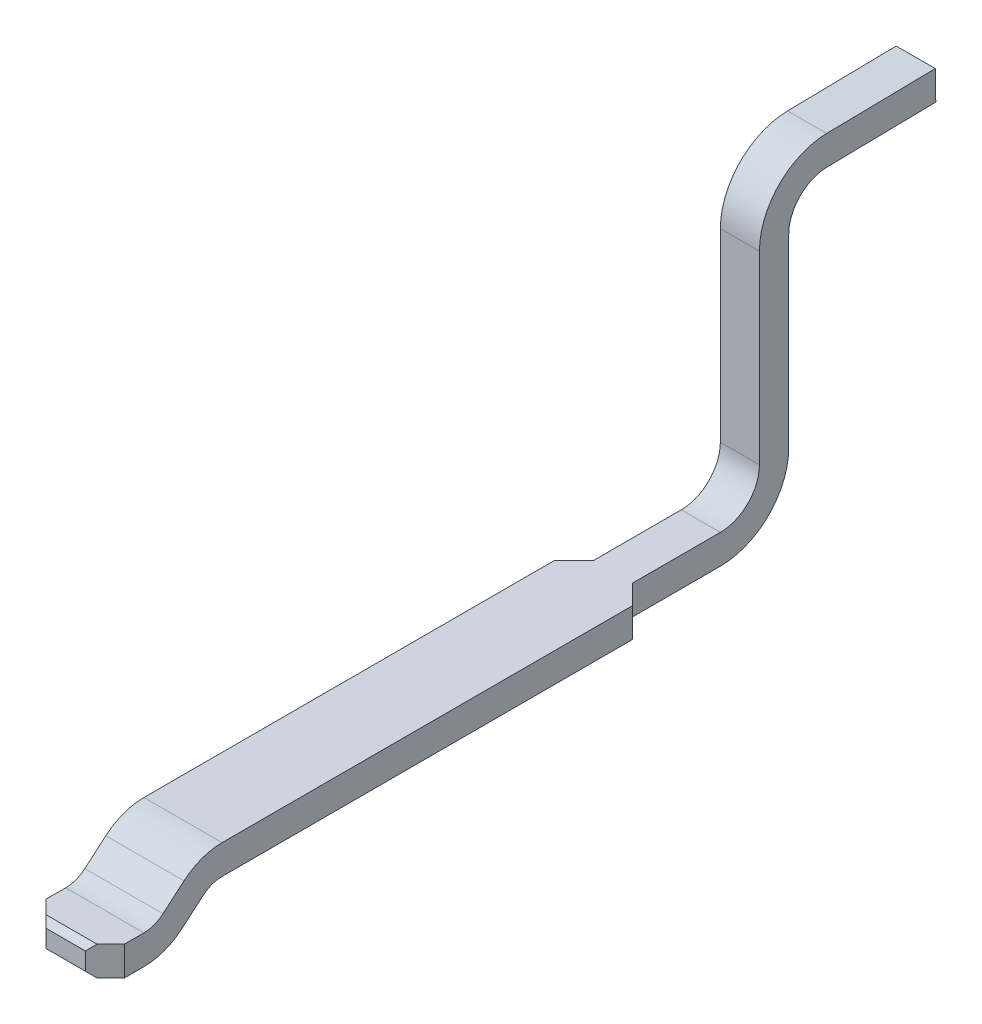
ISO-10303-21;
HEADER;
FILE_DESCRIPTION(('STEP AP214'),'2;1');
FILE_NAME('part.step','',(''),(''),'','','');
FILE_SCHEMA(('AUTOMOTIVE_DESIGN { 1 0 10303 214 1 1 1 1 }'));
ENDSEC;
DATA;
#1=APPLICATION_CONTEXT('core data for automotive mechanical design processes');
#2=APPLICATION_PROTOCOL_DEFINITION('international standard','automotive_design',2000,#1);
#3=PRODUCT_CONTEXT('',#1,'mechanical');
#4=PRODUCT('Part','Part','',(#3));
#5=PRODUCT_RELATED_PRODUCT_CATEGORY('part','',(#4));
#6=PRODUCT_DEFINITION_FORMATION('','',#4);
#7=PRODUCT_DEFINITION_CONTEXT('part definition',#1,'design');
#8=PRODUCT_DEFINITION('design','',#6,#7);
#9=PRODUCT_DEFINITION_SHAPE('','',#8);
#10=(LENGTH_UNIT() NAMED_UNIT(*) SI_UNIT(.MILLI.,.METRE.));
#11=(NAMED_UNIT(*) PLANE_ANGLE_UNIT() SI_UNIT($,.RADIAN.));
#12=(NAMED_UNIT(*) SI_UNIT($,.STERADIAN.) SOLID_ANGLE_UNIT());
#13=UNCERTAINTY_MEASURE_WITH_UNIT(LENGTH_MEASURE(1.E-05),#10,'distance_accuracy_value','');
#14=(GEOMETRIC_REPRESENTATION_CONTEXT(3) GLOBAL_UNCERTAINTY_ASSIGNED_CONTEXT((#13)) GLOBAL_UNIT_ASSIGNED_CONTEXT((#10,
#11,#12)) REPRESENTATION_CONTEXT('',''));
#15=CARTESIAN_POINT('',(0.,0.,0.));
#16=DIRECTION('',(0.,0.,1.));
#17=DIRECTION('',(1.,0.,0.));
#18=AXIS2_PLACEMENT_3D('',#15,#16,#17);
#19=CARTESIAN_POINT('',(-4.84596503503214,8.074228109921,4.324047830079));
#20=DIRECTION('',(0.,0.707106781186548,0.707106781186548));
#21=DIRECTION('',(0.,-0.707106781186548,0.707106781186548));
#22=AXIS2_PLACEMENT_3D('',#19,#20,#21);
#23=PLANE('',#22);
#24=DIRECTION('',(-0.577350269189631,0.577350269189615,-0.577350269189631));
#25=VECTOR('',#24,1.);
#26=CARTESIAN_POINT('',(-4.81026690000014,8.04019892,4.35807702));
#27=LINE('',#26,#25);
#28=CARTESIAN_POINT('',(-4.81026690000014,8.04019892,4.35807702));
#29=VERTEX_POINT('',#28);
#30=CARTESIAN_POINT('',(-4.84026690000014,8.07019892,4.32807702));
#31=VERTEX_POINT('',#30);
#32=EDGE_CURVE('E279',#29,#31,#27,.T.);
#33=ORIENTED_EDGE('',*,*,#32,.F.);
#34=DIRECTION('',(-1.,0.,0.));
#35=VECTOR('',#34,1.);
#36=CARTESIAN_POINT('',(-4.60456876496813,8.04019892,4.35807702));
#37=LINE('',#36,#35);
#38=CARTESIAN_POINT('',(-4.61026690000013,8.04019892,4.35807702));
#39=VERTEX_POINT('',#38);
#40=EDGE_CURVE('E356',#29,#39,#37,.F.);
#41=ORIENTED_EDGE('',*,*,#40,.T.);
#42=DIRECTION('',(-0.577350269189637,-0.57735026918962,0.57735026918962));
#43=VECTOR('',#42,1.);
#44=CARTESIAN_POINT('',(-4.58026690000013,8.07019892,4.32807702));
#45=LINE('',#44,#43);
#46=CARTESIAN_POINT('',(-4.58026690000013,8.07019892,4.32807702));
#47=VERTEX_POINT('',#46);
#48=EDGE_CURVE('E269',#47,#39,#45,.T.);
#49=ORIENTED_EDGE('',*,*,#48,.F.);
#50=DIRECTION('',(1.,0.,0.));
#51=VECTOR('',#50,1.);
#52=CARTESIAN_POINT('',(-4.50226690000014,8.07019892,4.32807702));
#53=LINE('',#52,#51);
#54=EDGE_CURVE('E276',#31,#47,#53,.T.);
#55=ORIENTED_EDGE('',*,*,#54,.F.);
#56=EDGE_LOOP('',(#33,#41,#49,#55));
#57=FACE_BOUND('',#56,.T.);
#58=ADVANCED_FACE('F17',(#57),#23,.T.);
#59=CARTESIAN_POINT('',(-4.60456876496813,7.944500784968,4.35807702));
#60=DIRECTION('',(0.,0.,-1.));
#61=DIRECTION('',(-1.,0.,0.));
#62=AXIS2_PLACEMENT_3D('',#59,#60,#61);
#63=PLANE('',#62);
#64=DIRECTION('',(0.,1.,0.));
#65=VECTOR('',#64,1.);
#66=CARTESIAN_POINT('',(-4.61026690000013,7.914500784968,4.35807702));
#67=LINE('',#66,#65);
#68=CARTESIAN_POINT('',(-4.61026690000013,7.95019892,4.35807702));
#69=VERTEX_POINT('',#68);
#70=EDGE_CURVE('E256',#39,#69,#67,.F.);
#71=ORIENTED_EDGE('',*,*,#70,.F.);
#72=ORIENTED_EDGE('',*,*,#40,.F.);
#73=DIRECTION('',(0.,1.,0.));
#74=VECTOR('',#73,1.);
#75=CARTESIAN_POINT('',(-4.81026690000014,7.914500784968,4.35807702));
#76=LINE('',#75,#74);
#77=CARTESIAN_POINT('',(-4.81026690000014,7.95019892,4.35807702));
#78=VERTEX_POINT('',#77);
#79=EDGE_CURVE('E338',#78,#29,#76,.T.);
#80=ORIENTED_EDGE('',*,*,#79,.F.);
#81=DIRECTION('',(1.,0.,0.));
#82=VECTOR('',#81,1.);
#83=CARTESIAN_POINT('',(-4.57456876496813,7.95019892,4.35807702));
#84=LINE('',#83,#82);
#85=EDGE_CURVE('E331',#69,#78,#84,.F.);
#86=ORIENTED_EDGE('',*,*,#85,.F.);
#87=EDGE_LOOP('',(#71,#72,#80,#86));
#88=FACE_BOUND('',#87,.T.);
#89=ADVANCED_FACE('F775',(#88),#63,.F.);
#90=CARTESIAN_POINT('',(-4.57456876496813,7.916169730079,4.324047830079));
#91=DIRECTION('',(0.,-0.707106781186548,0.707106781186548));
#92=DIRECTION('',(0.,-0.707106781186548,-0.707106781186548));
#93=AXIS2_PLACEMENT_3D('',#90,#91,#92);
#94=PLANE('',#93);
#95=DIRECTION('',(0.577350269189626,-0.577350269189642,-0.577350269189609));
#96=VECTOR('',#95,1.);
#97=CARTESIAN_POINT('',(-4.61026690000013,7.95019892,4.35807702));
#98=LINE('',#97,#96);
#99=CARTESIAN_POINT('',(-4.58026690000013,7.92019892,4.32807702));
#100=VERTEX_POINT('',#99);
#101=EDGE_CURVE('E270',#69,#100,#98,.T.);
#102=ORIENTED_EDGE('',*,*,#101,.F.);
#103=ORIENTED_EDGE('',*,*,#85,.T.);
#104=DIRECTION('',(0.57735026918962,0.577350269189637,0.57735026918962));
#105=VECTOR('',#104,1.);
#106=CARTESIAN_POINT('',(-4.84026690000013,7.92019892,4.32807702));
#107=LINE('',#106,#105);
#108=CARTESIAN_POINT('',(-4.84026690000014,7.92019892,4.32807702));
#109=VERTEX_POINT('',#108);
#110=EDGE_CURVE('E309',#109,#78,#107,.T.);
#111=ORIENTED_EDGE('',*,*,#110,.F.);
#112=DIRECTION('',(1.,0.,0.));
#113=VECTOR('',#112,1.);
#114=CARTESIAN_POINT('',(-4.50226690000014,7.92019892,4.32807702));
#115=LINE('',#114,#113);
#116=EDGE_CURVE('E252',#109,#100,#115,.T.);
#117=ORIENTED_EDGE('',*,*,#116,.T.);
#118=EDGE_LOOP('',(#102,#103,#111,#117));
#119=FACE_BOUND('',#118,.T.);
#120=ADVANCED_FACE('F768',(#119),#94,.T.);
#121=CARTESIAN_POINT('',(-4.60456876496813,8.45127780084181,0.758077020000001));
#122=DIRECTION('',(0.,0.,-1.));
#123=DIRECTION('',(-1.,0.,0.));
#124=AXIS2_PLACEMENT_3D('',#121,#122,#123);
#125=PLANE('',#124);
#126=DIRECTION('',(0.,1.,0.));
#127=VECTOR('',#126,1.);
#128=CARTESIAN_POINT('',(-4.61026690000013,9.610333059471,0.758077020000001));
#129=LINE('',#128,#127);
#130=CARTESIAN_POINT('',(-4.61026690000013,8.47019892,0.758077020000001));
#131=VERTEX_POINT('',#130);
#132=CARTESIAN_POINT('',(-4.61026690000013,9.41625487791,0.758077020000001));
#133=VERTEX_POINT('',#132);
#134=EDGE_CURVE('E416',#131,#133,#129,.T.);
#135=ORIENTED_EDGE('',*,*,#134,.F.);
#136=DIRECTION('',(-1.,0.,0.));
#137=VECTOR('',#136,1.);
#138=CARTESIAN_POINT('',(-4.61026690000013,8.47019892,0.75807702));
#139=LINE('',#138,#137);
#140=CARTESIAN_POINT('',(-4.81026690000014,8.47019892,0.758077020000001));
#141=VERTEX_POINT('',#140);
#142=EDGE_CURVE('E213',#141,#131,#139,.F.);
#143=ORIENTED_EDGE('',*,*,#142,.F.);
#144=DIRECTION('',(0.,1.,0.));
#145=VECTOR('',#144,1.);
#146=CARTESIAN_POINT('',(-4.81026690000014,8.45127780084181,0.758077020000001));
#147=LINE('',#146,#145);
#148=CARTESIAN_POINT('',(-4.81026690000014,9.41625487791,0.758077020000001));
#149=VERTEX_POINT('',#148);
#150=EDGE_CURVE('E412',#149,#141,#147,.F.);
#151=ORIENTED_EDGE('',*,*,#150,.F.);
#152=DIRECTION('',(1.,0.,0.));
#153=VECTOR('',#152,1.);
#154=CARTESIAN_POINT('',(-4.81026690000014,9.41625487791,0.758077020000001));
#155=LINE('',#154,#153);
#156=EDGE_CURVE('E306',#149,#133,#155,.T.);
#157=ORIENTED_EDGE('',*,*,#156,.T.);
#158=EDGE_LOOP('',(#135,#143,#151,#157));
#159=FACE_BOUND('',#158,.T.);
#160=ADVANCED_FACE('F579',(#159),#125,.T.);
#161=CARTESIAN_POINT('',(-4.61026690000013,8.47019892,1.10807702));
#162=DIRECTION('',(-1.,0.,0.));
#163=DIRECTION('',(0.,0.,1.));
#164=AXIS2_PLACEMENT_3D('',#161,#162,#163);
#165=CYLINDRICAL_SURFACE('',#164,0.35);
#166=DIRECTION('',(1.,0.,0.));
#167=VECTOR('',#166,1.);
#168=CARTESIAN_POINT('',(-4.50226690000014,8.12019892,1.10807702));
#169=LINE('',#168,#167);
#170=CARTESIAN_POINT('',(-4.61026690000013,8.12019892,1.10807702));
#171=VERTEX_POINT('',#170);
#172=CARTESIAN_POINT('',(-4.81026690000014,8.12019892,1.10807702));
#173=VERTEX_POINT('',#172);
#174=EDGE_CURVE('E229',#171,#173,#169,.F.);
#175=ORIENTED_EDGE('',*,*,#174,.T.);
#176=CARTESIAN_POINT('',(-4.81026690000014,8.47019892,1.10807702));
#177=DIRECTION('',(-1.,0.,0.));
#178=DIRECTION('',(0.,0.,1.));
#179=AXIS2_PLACEMENT_3D('',#176,#177,#178);
#180=CIRCLE('',#179,0.35);
#181=EDGE_CURVE('E409',#141,#173,#180,.T.);
#182=ORIENTED_EDGE('',*,*,#181,.F.);
#183=ORIENTED_EDGE('',*,*,#142,.T.);
#184=CARTESIAN_POINT('',(-4.61026690000013,8.47019892,1.10807702));
#185=DIRECTION('',(-1.,0.,0.));
#186=DIRECTION('',(0.,0.,1.));
#187=AXIS2_PLACEMENT_3D('',#184,#185,#186);
#188=CIRCLE('',#187,0.35);
#189=EDGE_CURVE('E417',#171,#131,#188,.F.);
#190=ORIENTED_EDGE('',*,*,#189,.F.);
#191=EDGE_LOOP('',(#175,#182,#183,#190));
#192=FACE_BOUND('',#191,.T.);
#193=ADVANCED_FACE('F576',(#192),#165,.T.);
#194=CARTESIAN_POINT('',(-4.60456876496813,8.45127780084181,0.908077020000001));
#195=DIRECTION('',(0.,0.,-1.));
#196=DIRECTION('',(-1.,0.,0.));
#197=AXIS2_PLACEMENT_3D('',#194,#195,#196);
#198=PLANE('',#197);
#199=DIRECTION('',(-1.,0.,0.));
#200=VECTOR('',#199,1.);
#201=CARTESIAN_POINT('',(-4.61026690000013,8.47019892,0.90807702));
#202=LINE('',#201,#200);
#203=CARTESIAN_POINT('',(-4.81026690000014,8.47019892,0.908077020000001));
#204=VERTEX_POINT('',#203);
#205=CARTESIAN_POINT('',(-4.61026690000013,8.47019892,0.908077020000001));
#206=VERTEX_POINT('',#205);
#207=EDGE_CURVE('E218',#204,#206,#202,.F.);
#208=ORIENTED_EDGE('',*,*,#207,.T.);
#209=DIRECTION('',(0.,1.,0.));
#210=VECTOR('',#209,1.);
#211=CARTESIAN_POINT('',(-4.61026690000013,9.610333059471,0.908077020000001));
#212=LINE('',#211,#210);
#213=CARTESIAN_POINT('',(-4.61026690000013,9.41625487791,0.908077020000001));
#214=VERTEX_POINT('',#213);
#215=EDGE_CURVE('E216',#214,#206,#212,.F.);
#216=ORIENTED_EDGE('',*,*,#215,.F.);
#217=DIRECTION('',(1.,0.,0.));
#218=VECTOR('',#217,1.);
#219=CARTESIAN_POINT('',(-4.81026690000014,9.41625487791,0.908077020000001));
#220=LINE('',#219,#218);
#221=CARTESIAN_POINT('',(-4.81026690000014,9.41625487791,0.908077020000001));
#222=VERTEX_POINT('',#221);
#223=EDGE_CURVE('E203',#222,#214,#220,.T.);
#224=ORIENTED_EDGE('',*,*,#223,.F.);
#225=DIRECTION('',(0.,1.,0.));
#226=VECTOR('',#225,1.);
#227=CARTESIAN_POINT('',(-4.81026690000014,8.45127780084181,0.908077020000001));
#228=LINE('',#227,#226);
#229=EDGE_CURVE('E404',#204,#222,#228,.T.);
#230=ORIENTED_EDGE('',*,*,#229,.F.);
#231=EDGE_LOOP('',(#208,#216,#224,#230));
#232=FACE_BOUND('',#231,.T.);
#233=ADVANCED_FACE('F217',(#232),#198,.F.);
#234=CARTESIAN_POINT('',(-4.81026690000014,9.41625487791,0.558077020000001));
#235=DIRECTION('',(1.,0.,0.));
#236=DIRECTION('',(0.,0.,-1.));
#237=AXIS2_PLACEMENT_3D('',#234,#235,#236);
#238=CYLINDRICAL_SURFACE('',#237,0.35);
#239=ORIENTED_EDGE('',*,*,#223,.T.);
#240=CARTESIAN_POINT('',(-4.61026690000013,9.41625487791,0.558077020000001));
#241=DIRECTION('',(1.,0.,0.));
#242=DIRECTION('',(0.,0.,-1.));
#243=AXIS2_PLACEMENT_3D('',#240,#241,#242);
#244=CIRCLE('',#243,0.35);
#245=CARTESIAN_POINT('',(-4.61026690000013,9.76620157121429,0.564185362253241));
#246=VERTEX_POINT('',#245);
#247=EDGE_CURVE('E20',#246,#214,#244,.T.);
#248=ORIENTED_EDGE('',*,*,#247,.F.);
#249=DIRECTION('',(1.,0.,0.));
#250=VECTOR('',#249,1.);
#251=CARTESIAN_POINT('',(-4.81596503503213,9.76620157121458,0.564185362253011));
#252=LINE('',#251,#250);
#253=CARTESIAN_POINT('',(-4.81026690000014,9.76620157121429,0.564185362253241));
#254=VERTEX_POINT('',#253);
#255=EDGE_CURVE('E198',#254,#246,#252,.T.);
#256=ORIENTED_EDGE('',*,*,#255,.F.);
#257=CARTESIAN_POINT('',(-4.81026690000014,9.41625487791,0.558077020000001));
#258=DIRECTION('',(1.,0.,0.));
#259=DIRECTION('',(0.,0.,-1.));
#260=AXIS2_PLACEMENT_3D('',#257,#258,#259);
#261=CIRCLE('',#260,0.35);
#262=EDGE_CURVE('E209',#222,#254,#261,.F.);
#263=ORIENTED_EDGE('',*,*,#262,.F.);
#264=EDGE_LOOP('',(#239,#248,#256,#263));
#265=FACE_BOUND('',#264,.T.);
#266=ADVANCED_FACE('F205',(#265),#238,.T.);
#267=CARTESIAN_POINT('',(-4.81596503503213,9.766007480923,0.575304787611001));
#268=DIRECTION('',(0.,0.999847695156406,0.0174524064364471));
#269=DIRECTION('',(0.,-0.0174524064364471,0.999847695156406));
#270=AXIS2_PLACEMENT_3D('',#267,#268,#269);
#271=PLANE('',#270);
#272=DIRECTION('',(0.,0.0174524064385203,-0.99984769515637));
#273=VECTOR('',#272,1.);
#274=CARTESIAN_POINT('',(-4.81026690000014,9.766201571214,0.564185362253001));
#275=LINE('',#274,#273);
#276=CARTESIAN_POINT('',(-4.81026690000014,9.775906085794,0.00821409435916126));
#277=VERTEX_POINT('',#276);
#278=EDGE_CURVE('E318',#254,#277,#275,.T.);
#279=ORIENTED_EDGE('',*,*,#278,.F.);
#280=ORIENTED_EDGE('',*,*,#255,.T.);
#281=DIRECTION('',(0.,-0.0174524064385203,0.99984769515637));
#282=VECTOR('',#281,1.);
#283=CARTESIAN_POINT('',(-4.61026690000013,9.775906085794,0.00821409435900074));
#284=LINE('',#283,#282);
#285=CARTESIAN_POINT('',(-4.61026690000013,9.775906085794,0.00821409435916126));
#286=VERTEX_POINT('',#285);
#287=EDGE_CURVE('E226',#286,#246,#284,.T.);
#288=ORIENTED_EDGE('',*,*,#287,.F.);
#289=DIRECTION('',(1.,0.,0.));
#290=VECTOR('',#289,1.);
#291=CARTESIAN_POINT('',(-4.60456876496813,9.77590608579399,0.0082140943594823));
#292=LINE('',#291,#290);
#293=EDGE_CURVE('E311',#277,#286,#292,.T.);
#294=ORIENTED_EDGE('',*,*,#293,.F.);
#295=EDGE_LOOP('',(#279,#280,#288,#294));
#296=FACE_BOUND('',#295,.T.);
#297=ADVANCED_FACE('F593',(#296),#271,.T.);
#298=CARTESIAN_POINT('',(-4.60456876496813,9.620231664342,0.00549678722500089));
#299=DIRECTION('',(0.,0.0174524064396861,-0.999847695156349));
#300=DIRECTION('',(0.,0.999847695156349,0.0174524064396861));
#301=AXIS2_PLACEMENT_3D('',#298,#299,#300);
#302=PLANE('',#301);
#303=DIRECTION('',(1.,0.,0.));
#304=VECTOR('',#303,1.);
#305=CARTESIAN_POINT('',(-4.81596503503213,9.62592893152041,0.00559623339400797));
#306=LINE('',#305,#304);
#307=CARTESIAN_POINT('',(-4.61026690000013,9.62592893152018,0.00559623339400417));
#308=VERTEX_POINT('',#307);
#309=CARTESIAN_POINT('',(-4.81026690000014,9.62592893152014,0.00559623339400334));
#310=VERTEX_POINT('',#309);
#311=EDGE_CURVE('E307',#308,#310,#306,.F.);
#312=ORIENTED_EDGE('',*,*,#311,.T.);
#313=DIRECTION('',(0.,-0.999847695156461,-0.0174524064332696));
#314=VECTOR('',#313,1.);
#315=CARTESIAN_POINT('',(-4.81026690000014,9.775906085794,0.00821409435900074));
#316=LINE('',#315,#314);
#317=EDGE_CURVE('E314',#277,#310,#316,.T.);
#318=ORIENTED_EDGE('',*,*,#317,.F.);
#319=ORIENTED_EDGE('',*,*,#293,.T.);
#320=DIRECTION('',(0.,0.999847695156461,0.0174524064332696));
#321=VECTOR('',#320,1.);
#322=CARTESIAN_POINT('',(-4.61026690000013,9.62592893152,0.00559623339400103));
#323=LINE('',#322,#321);
#324=EDGE_CURVE('E328',#308,#286,#323,.T.);
#325=ORIENTED_EDGE('',*,*,#324,.F.);
#326=EDGE_LOOP('',(#312,#318,#319,#325));
#327=FACE_BOUND('',#326,.T.);
#328=ADVANCED_FACE('F592',(#327),#302,.T.);
#329=CARTESIAN_POINT('',(-4.81596503503213,9.616030326649,0.572686926645001));
#330=DIRECTION('',(0.,0.999847695156375,0.0174524064382066));
#331=DIRECTION('',(0.,-0.0174524064382066,0.999847695156375));
#332=AXIS2_PLACEMENT_3D('',#329,#330,#331);
#333=PLANE('',#332);
#334=DIRECTION('',(1.,0.,0.));
#335=VECTOR('',#334,1.);
#336=CARTESIAN_POINT('',(-4.81026690000014,9.61622441694128,0.561567501287006));
#337=LINE('',#336,#335);
#338=CARTESIAN_POINT('',(-4.61026690000013,9.61622441694114,0.561567501287176));
#339=VERTEX_POINT('',#338);
#340=CARTESIAN_POINT('',(-4.81026690000014,9.61622441694114,0.561567501287176));
#341=VERTEX_POINT('',#340);
#342=EDGE_CURVE('E304',#339,#341,#337,.F.);
#343=ORIENTED_EDGE('',*,*,#342,.T.);
#344=DIRECTION('',(0.,-0.0174524064367521,0.999847695156401));
#345=VECTOR('',#344,1.);
#346=CARTESIAN_POINT('',(-4.81026690000014,9.62592893152,0.00559623339400103));
#347=LINE('',#346,#345);
#348=EDGE_CURVE('E317',#310,#341,#347,.T.);
#349=ORIENTED_EDGE('',*,*,#348,.F.);
#350=ORIENTED_EDGE('',*,*,#311,.F.);
#351=DIRECTION('',(0.,0.0174524064367521,-0.999847695156401));
#352=VECTOR('',#351,1.);
#353=CARTESIAN_POINT('',(-4.61026690000013,9.616224416941,0.561567501287001));
#354=LINE('',#353,#352);
#355=EDGE_CURVE('E333',#339,#308,#354,.T.);
#356=ORIENTED_EDGE('',*,*,#355,.F.);
#357=EDGE_LOOP('',(#343,#349,#350,#356));
#358=FACE_BOUND('',#357,.T.);
#359=ADVANCED_FACE('F588',(#358),#333,.F.);
#360=CARTESIAN_POINT('',(-4.81026690000014,9.41625487791,0.558077020000001));
#361=DIRECTION('',(1.,0.,0.));
#362=DIRECTION('',(0.,0.,-1.));
#363=AXIS2_PLACEMENT_3D('',#360,#361,#362);
#364=CYLINDRICAL_SURFACE('',#363,0.2);
#365=ORIENTED_EDGE('',*,*,#156,.F.);
#366=CARTESIAN_POINT('',(-4.81026690000014,9.41625487791,0.558077020000001));
#367=DIRECTION('',(1.,0.,0.));
#368=DIRECTION('',(0.,0.,-1.));
#369=AXIS2_PLACEMENT_3D('',#366,#367,#368);
#370=CIRCLE('',#369,0.2);
#371=EDGE_CURVE('E400',#341,#149,#370,.T.);
#372=ORIENTED_EDGE('',*,*,#371,.F.);
#373=ORIENTED_EDGE('',*,*,#342,.F.);
#374=CARTESIAN_POINT('',(-4.61026690000013,9.41625487791,0.558077020000001));
#375=DIRECTION('',(1.,0.,0.));
#376=DIRECTION('',(0.,0.,-1.));
#377=AXIS2_PLACEMENT_3D('',#374,#375,#376);
#378=CIRCLE('',#377,0.2);
#379=EDGE_CURVE('E414',#133,#339,#378,.F.);
#380=ORIENTED_EDGE('',*,*,#379,.F.);
#381=EDGE_LOOP('',(#365,#372,#373,#380));
#382=FACE_BOUND('',#381,.T.);
#383=ADVANCED_FACE('F584',(#382),#364,.F.);
#384=CARTESIAN_POINT('',(-4.91429608992113,7.914500784968,4.254047830079));
#385=DIRECTION('',(-0.707106781186548,0.,0.707106781186548));
#386=DIRECTION('',(0.707106781186548,0.,0.707106781186548));
#387=AXIS2_PLACEMENT_3D('',#384,#385,#386);
#388=PLANE('',#387);
#389=DIRECTION('',(0.,1.,0.));
#390=VECTOR('',#389,1.);
#391=CARTESIAN_POINT('',(-4.91026690000013,7.914500784968,4.25807702));
#392=LINE('',#391,#390);
#393=CARTESIAN_POINT('',(-4.91026690000013,8.07019892,4.25807702));
#394=VERTEX_POINT('',#393);
#395=CARTESIAN_POINT('',(-4.91026690000013,7.92019892,4.25807702));
#396=VERTEX_POINT('',#395);
#397=EDGE_CURVE('E295',#394,#396,#392,.F.);
#398=ORIENTED_EDGE('',*,*,#397,.T.);
#399=DIRECTION('',(0.707106781186499,0.,0.707106781186596));
#400=VECTOR('',#399,1.);
#401=CARTESIAN_POINT('',(-4.91026690000013,7.92019892,4.25807702));
#402=LINE('',#401,#400);
#403=EDGE_CURVE('E255',#396,#109,#402,.T.);
#404=ORIENTED_EDGE('',*,*,#403,.T.);
#405=ORIENTED_EDGE('',*,*,#110,.T.);
#406=ORIENTED_EDGE('',*,*,#79,.T.);
#407=ORIENTED_EDGE('',*,*,#32,.T.);
#408=DIRECTION('',(0.707106781186499,0.,0.707106781186596));
#409=VECTOR('',#408,1.);
#410=CARTESIAN_POINT('',(-4.91026690000013,8.07019892,4.25807702));
#411=LINE('',#410,#409);
#412=EDGE_CURVE('E275',#394,#31,#411,.T.);
#413=ORIENTED_EDGE('',*,*,#412,.F.);
#414=EDGE_LOOP('',(#398,#404,#405,#406,#407,#413));
#415=FACE_BOUND('',#414,.T.);
#416=ADVANCED_FACE('F712',(#415),#388,.T.);
#417=CARTESIAN_POINT('',(-4.50226690000014,8.102515836027,4.064893542443));
#418=DIRECTION('',(0.,0.759858617954068,0.650088363779058));
#419=DIRECTION('',(0.,-0.650088363779058,0.759858617954068));
#420=AXIS2_PLACEMENT_3D('',#417,#418,#419);
#421=PLANE('',#420);
#422=DIRECTION('',(0.,-0.650088363774947,0.759858617957586));
#423=VECTOR('',#422,1.);
#424=CARTESIAN_POINT('',(-4.91026690000013,8.198156505386,3.953103529133));
#425=LINE('',#424,#423);
#426=CARTESIAN_POINT('',(-4.91026690000013,8.19815650538664,3.95310352913274));
#427=VERTEX_POINT('',#426);
#428=CARTESIAN_POINT('',(-4.91026690000013,8.10622012730668,4.06056376543338));
#429=VERTEX_POINT('',#428);
#430=EDGE_CURVE('E393',#427,#429,#425,.T.);
#431=ORIENTED_EDGE('',*,*,#430,.T.);
#432=DIRECTION('',(-1.,0.,0.));
#433=VECTOR('',#432,1.);
#434=CARTESIAN_POINT('',(-4.51026690000013,8.10622012730701,4.06056376543301));
#435=LINE('',#434,#433);
#436=CARTESIAN_POINT('',(-4.51026690000013,8.10622012730668,4.06056376543338));
#437=VERTEX_POINT('',#436);
#438=EDGE_CURVE('E277',#429,#437,#435,.F.);
#439=ORIENTED_EDGE('',*,*,#438,.T.);
#440=DIRECTION('',(0.,-0.650088363774947,0.759858617957586));
#441=VECTOR('',#440,1.);
#442=CARTESIAN_POINT('',(-4.51026690000013,8.198156505386,3.953103529133));
#443=LINE('',#442,#441);
#444=CARTESIAN_POINT('',(-4.51026690000013,8.19815650538664,3.95310352913274));
#445=VERTEX_POINT('',#444);
#446=EDGE_CURVE('E385',#445,#437,#443,.T.);
#447=ORIENTED_EDGE('',*,*,#446,.F.);
#448=DIRECTION('',(-1.,0.,0.));
#449=VECTOR('',#448,1.);
#450=CARTESIAN_POINT('',(-4.51026690000013,8.19815650538648,3.95310352913341));
#451=LINE('',#450,#449);
#452=EDGE_CURVE('E280',#427,#445,#451,.F.);
#453=ORIENTED_EDGE('',*,*,#452,.F.);
#454=EDGE_LOOP('',(#431,#439,#447,#453));
#455=FACE_BOUND('',#454,.T.);
#456=ADVANCED_FACE('F528',(#455),#421,.T.);
#457=CARTESIAN_POINT('',(-4.51026690000013,8.22019892,4.15807702));
#458=DIRECTION('',(-1.,0.,0.));
#459=DIRECTION('',(0.,0.,1.));
#460=AXIS2_PLACEMENT_3D('',#457,#458,#459);
#461=CYLINDRICAL_SURFACE('',#460,0.15);
#462=CARTESIAN_POINT('',(-4.91026690000013,8.22019892,4.15807702));
#463=DIRECTION('',(-1.,0.,0.));
#464=DIRECTION('',(0.,0.,1.));
#465=AXIS2_PLACEMENT_3D('',#462,#463,#464);
#466=CIRCLE('',#465,0.15);
#467=CARTESIAN_POINT('',(-4.91026690000013,8.07019892,4.15807702));
#468=VERTEX_POINT('',#467);
#469=EDGE_CURVE('E390',#429,#468,#466,.T.);
#470=ORIENTED_EDGE('',*,*,#469,.T.);
#471=DIRECTION('',(1.,0.,0.));
#472=VECTOR('',#471,1.);
#473=CARTESIAN_POINT('',(-4.50226690000014,8.07019892,4.15807702));
#474=LINE('',#473,#472);
#475=CARTESIAN_POINT('',(-4.51026690000013,8.07019892,4.15807702));
#476=VERTEX_POINT('',#475);
#477=EDGE_CURVE('E273',#476,#468,#474,.F.);
#478=ORIENTED_EDGE('',*,*,#477,.F.);
#479=CARTESIAN_POINT('',(-4.51026690000013,8.22019892,4.15807702));
#480=DIRECTION('',(-1.,0.,0.));
#481=DIRECTION('',(0.,0.,1.));
#482=AXIS2_PLACEMENT_3D('',#479,#480,#481);
#483=CIRCLE('',#482,0.15);
#484=EDGE_CURVE('E382',#437,#476,#483,.T.);
#485=ORIENTED_EDGE('',*,*,#484,.F.);
#486=ORIENTED_EDGE('',*,*,#438,.F.);
#487=EDGE_LOOP('',(#470,#478,#485,#486));
#488=FACE_BOUND('',#487,.T.);
#489=ADVANCED_FACE('F533',(#488),#461,.F.);
#490=CARTESIAN_POINT('',(-4.50226690000014,8.07019892,4.333775155032));
#491=DIRECTION('',(0.,1.,0.));
#492=DIRECTION('',(0.,0.,1.));
#493=AXIS2_PLACEMENT_3D('',#490,#491,#492);
#494=PLANE('',#493);
#495=DIRECTION('',(0.,0.,-1.));
#496=VECTOR('',#495,1.);
#497=CARTESIAN_POINT('',(-4.91026690000013,8.07019892,4.163775155032));
#498=LINE('',#497,#496);
#499=EDGE_CURVE('E287',#468,#394,#498,.F.);
#500=ORIENTED_EDGE('',*,*,#499,.T.);
#501=ORIENTED_EDGE('',*,*,#412,.T.);
#502=ORIENTED_EDGE('',*,*,#54,.T.);
#503=DIRECTION('',(0.707106781186548,0.,-0.707106781186548));
#504=VECTOR('',#503,1.);
#505=CARTESIAN_POINT('',(-4.61429608992113,8.07019892,4.362106209921));
#506=LINE('',#505,#504);
#507=CARTESIAN_POINT('',(-4.51026690000013,8.07019892,4.25807702));
#508=VERTEX_POINT('',#507);
#509=EDGE_CURVE('E266',#508,#47,#506,.F.);
#510=ORIENTED_EDGE('',*,*,#509,.F.);
#511=DIRECTION('',(0.,0.,-1.));
#512=VECTOR('',#511,1.);
#513=CARTESIAN_POINT('',(-4.51026690000013,8.07019892,3.80007702));
#514=LINE('',#513,#512);
#515=EDGE_CURVE('E263',#476,#508,#514,.F.);
#516=ORIENTED_EDGE('',*,*,#515,.F.);
#517=ORIENTED_EDGE('',*,*,#477,.T.);
#518=EDGE_LOOP('',(#500,#501,#502,#510,#516,#517));
#519=FACE_BOUND('',#518,.T.);
#520=ADVANCED_FACE('F537',(#519),#494,.T.);
#521=CARTESIAN_POINT('',(-4.61429608992113,7.914500784968,4.362106209921));
#522=DIRECTION('',(0.707106781186548,0.,0.707106781186548));
#523=DIRECTION('',(0.707106781186548,0.,-0.707106781186548));
#524=AXIS2_PLACEMENT_3D('',#521,#522,#523);
#525=PLANE('',#524);
#526=ORIENTED_EDGE('',*,*,#48,.T.);
#527=ORIENTED_EDGE('',*,*,#70,.T.);
#528=ORIENTED_EDGE('',*,*,#101,.T.);
#529=DIRECTION('',(0.707106781186543,0.,-0.707106781186552));
#530=VECTOR('',#529,1.);
#531=CARTESIAN_POINT('',(-4.58026690000013,7.92019892,4.32807702));
#532=LINE('',#531,#530);
#533=CARTESIAN_POINT('',(-4.51026690000013,7.92019892,4.25807702));
#534=VERTEX_POINT('',#533);
#535=EDGE_CURVE('E253',#100,#534,#532,.T.);
#536=ORIENTED_EDGE('',*,*,#535,.T.);
#537=DIRECTION('',(0.,1.,0.));
#538=VECTOR('',#537,1.);
#539=CARTESIAN_POINT('',(-4.51026690000013,8.114500784968,4.25807702));
#540=LINE('',#539,#538);
#541=EDGE_CURVE('E259',#508,#534,#540,.F.);
#542=ORIENTED_EDGE('',*,*,#541,.F.);
#543=ORIENTED_EDGE('',*,*,#509,.T.);
#544=EDGE_LOOP('',(#526,#527,#528,#536,#542,#543));
#545=FACE_BOUND('',#544,.T.);
#546=ADVANCED_FACE('F540',(#545),#525,.T.);
#547=CARTESIAN_POINT('',(-4.50226690000014,7.92019892,4.333775155032));
#548=DIRECTION('',(0.,1.,0.));
#549=DIRECTION('',(0.,0.,1.));
#550=AXIS2_PLACEMENT_3D('',#547,#548,#549);
#551=PLANE('',#550);
#552=ORIENTED_EDGE('',*,*,#403,.F.);
#553=DIRECTION('',(0.,0.,-1.));
#554=VECTOR('',#553,1.);
#555=CARTESIAN_POINT('',(-4.91026690000013,7.92019892,4.163775155032));
#556=LINE('',#555,#554);
#557=CARTESIAN_POINT('',(-4.91026690000013,7.92019892,4.15807702));
#558=VERTEX_POINT('',#557);
#559=EDGE_CURVE('E297',#396,#558,#556,.T.);
#560=ORIENTED_EDGE('',*,*,#559,.T.);
#561=DIRECTION('',(-1.,0.,0.));
#562=VECTOR('',#561,1.);
#563=CARTESIAN_POINT('',(-4.51026690000013,7.92019892,4.15807702));
#564=LINE('',#563,#562);
#565=CARTESIAN_POINT('',(-4.51026690000013,7.92019892,4.15807702));
#566=VERTEX_POINT('',#565);
#567=EDGE_CURVE('E249',#566,#558,#564,.T.);
#568=ORIENTED_EDGE('',*,*,#567,.F.);
#569=DIRECTION('',(0.,0.,-1.));
#570=VECTOR('',#569,1.);
#571=CARTESIAN_POINT('',(-4.51026690000013,7.92019892,3.80007702));
#572=LINE('',#571,#570);
#573=EDGE_CURVE('E262',#534,#566,#572,.T.);
#574=ORIENTED_EDGE('',*,*,#573,.F.);
#575=ORIENTED_EDGE('',*,*,#535,.F.);
#576=ORIENTED_EDGE('',*,*,#116,.F.);
#577=EDGE_LOOP('',(#552,#560,#568,#574,#575,#576));
#578=FACE_BOUND('',#577,.T.);
#579=ADVANCED_FACE('F547',(#578),#551,.F.);
#580=CARTESIAN_POINT('',(-4.51026690000013,8.22019892,4.15807702));
#581=DIRECTION('',(-1.,0.,0.));
#582=DIRECTION('',(0.,0.,1.));
#583=AXIS2_PLACEMENT_3D('',#580,#581,#582);
#584=CYLINDRICAL_SURFACE('',#583,0.3);
#585=CARTESIAN_POINT('',(-4.91026690000013,8.22019892,4.15807702));
#586=DIRECTION('',(-1.,0.,0.));
#587=DIRECTION('',(0.,0.,1.));
#588=AXIS2_PLACEMENT_3D('',#585,#586,#587);
#589=CIRCLE('',#588,0.3);
#590=CARTESIAN_POINT('',(-4.91026690000013,7.99224133461339,3.96305051086728));
#591=VERTEX_POINT('',#590);
#592=EDGE_CURVE('E398',#558,#591,#589,.F.);
#593=ORIENTED_EDGE('',*,*,#592,.T.);
#594=DIRECTION('',(1.,0.,0.));
#595=VECTOR('',#594,1.);
#596=CARTESIAN_POINT('',(-4.50226690000014,7.99224133461357,3.96305051086664));
#597=LINE('',#596,#595);
#598=CARTESIAN_POINT('',(-4.51026690000013,7.99224133461339,3.96305051086728));
#599=VERTEX_POINT('',#598);
#600=EDGE_CURVE('E247',#591,#599,#597,.T.);
#601=ORIENTED_EDGE('',*,*,#600,.T.);
#602=CARTESIAN_POINT('',(-4.51026690000013,8.22019892,4.15807702));
#603=DIRECTION('',(-1.,0.,0.));
#604=DIRECTION('',(0.,0.,1.));
#605=AXIS2_PLACEMENT_3D('',#602,#603,#604);
#606=CIRCLE('',#605,0.3);
#607=EDGE_CURVE('E379',#566,#599,#606,.F.);
#608=ORIENTED_EDGE('',*,*,#607,.F.);
#609=ORIENTED_EDGE('',*,*,#567,.T.);
#610=EDGE_LOOP('',(#593,#601,#608,#609));
#611=FACE_BOUND('',#610,.T.);
#612=ADVANCED_FACE('F551',(#611),#584,.T.);
#613=CARTESIAN_POINT('',(-4.50226690000014,7.988537043334,3.967380287877));
#614=DIRECTION('',(0.,0.759858617954068,0.650088363779058));
#615=DIRECTION('',(0.,-0.650088363779058,0.759858617954068));
#616=AXIS2_PLACEMENT_3D('',#613,#614,#615);
#617=PLANE('',#616);
#618=ORIENTED_EDGE('',*,*,#600,.F.);
#619=DIRECTION('',(0.,0.650088363774937,-0.759858617957595));
#620=VECTOR('',#619,1.);
#621=CARTESIAN_POINT('',(-4.91026690000013,7.992241334614,3.963050510867));
#622=LINE('',#621,#620);
#623=CARTESIAN_POINT('',(-4.91026690000013,8.08417771269332,3.85559027456662));
#624=VERTEX_POINT('',#623);
#625=EDGE_CURVE('E397',#591,#624,#622,.T.);
#626=ORIENTED_EDGE('',*,*,#625,.T.);
#627=DIRECTION('',(-1.,0.,0.));
#628=VECTOR('',#627,1.);
#629=CARTESIAN_POINT('',(-4.51026690000013,8.08417771269299,3.85559027456699));
#630=LINE('',#629,#628);
#631=CARTESIAN_POINT('',(-4.51026690000013,8.08417771269332,3.85559027456662));
#632=VERTEX_POINT('',#631);
#633=EDGE_CURVE('E243',#624,#632,#630,.F.);
#634=ORIENTED_EDGE('',*,*,#633,.T.);
#635=DIRECTION('',(0.,0.650088363774937,-0.759858617957595));
#636=VECTOR('',#635,1.);
#637=CARTESIAN_POINT('',(-4.51026690000013,7.992241334614,3.963050510867));
#638=LINE('',#637,#636);
#639=EDGE_CURVE('E378',#599,#632,#638,.T.);
#640=ORIENTED_EDGE('',*,*,#639,.F.);
#641=EDGE_LOOP('',(#618,#626,#634,#640));
#642=FACE_BOUND('',#641,.T.);
#643=ADVANCED_FACE('F556',(#642),#617,.F.);
#644=CARTESIAN_POINT('',(-4.51026690000013,7.97019892,3.75807702));
#645=DIRECTION('',(-1.,0.,0.));
#646=DIRECTION('',(0.,0.,1.));
#647=AXIS2_PLACEMENT_3D('',#644,#645,#646);
#648=CYLINDRICAL_SURFACE('',#647,0.15);
#649=CARTESIAN_POINT('',(-4.91026690000013,7.97019892,3.75807702));
#650=DIRECTION('',(-1.,0.,0.));
#651=DIRECTION('',(0.,0.,1.));
#652=AXIS2_PLACEMENT_3D('',#649,#650,#651);
#653=CIRCLE('',#652,0.15);
#654=CARTESIAN_POINT('',(-4.91026690000013,8.12019892,3.75807702));
#655=VERTEX_POINT('',#654);
#656=EDGE_CURVE('E394',#624,#655,#653,.T.);
#657=ORIENTED_EDGE('',*,*,#656,.T.);
#658=DIRECTION('',(1.,0.,0.));
#659=VECTOR('',#658,1.);
#660=CARTESIAN_POINT('',(-4.50226690000014,8.12019892,3.75807702));
#661=LINE('',#660,#659);
#662=CARTESIAN_POINT('',(-4.51026690000013,8.12019892,3.75807702));
#663=VERTEX_POINT('',#662);
#664=EDGE_CURVE('E227',#655,#663,#661,.T.);
#665=ORIENTED_EDGE('',*,*,#664,.T.);
#666=CARTESIAN_POINT('',(-4.51026690000013,7.97019892,3.75807702));
#667=DIRECTION('',(-1.,0.,0.));
#668=DIRECTION('',(0.,0.,1.));
#669=AXIS2_PLACEMENT_3D('',#666,#667,#668);
#670=CIRCLE('',#669,0.15);
#671=EDGE_CURVE('E374',#632,#663,#670,.T.);
#672=ORIENTED_EDGE('',*,*,#671,.F.);
#673=ORIENTED_EDGE('',*,*,#633,.F.);
#674=EDGE_LOOP('',(#657,#665,#672,#673));
#675=FACE_BOUND('',#674,.T.);
#676=ADVANCED_FACE('F560',(#675),#648,.F.);
#677=CARTESIAN_POINT('',(-4.50226690000014,8.12019892,3.81107702));
#678=DIRECTION('',(0.,1.,0.));
#679=DIRECTION('',(0.,0.,1.));
#680=AXIS2_PLACEMENT_3D('',#677,#678,#679);
#681=PLANE('',#680);
#682=ORIENTED_EDGE('',*,*,#664,.F.);
#683=DIRECTION('',(0.,0.,-1.));
#684=VECTOR('',#683,1.);
#685=CARTESIAN_POINT('',(-4.91026690000013,8.12019892,4.163775155032));
#686=LINE('',#685,#684);
#687=CARTESIAN_POINT('',(-4.91026690000013,8.12019892,1.65807702));
#688=VERTEX_POINT('',#687);
#689=EDGE_CURVE('E396',#655,#688,#686,.T.);
#690=ORIENTED_EDGE('',*,*,#689,.T.);
#691=DIRECTION('',(-0.707106781186548,0.,0.707106781186548));
#692=VECTOR('',#691,1.);
#693=CARTESIAN_POINT('',(-4.91429608992113,8.12019892,1.662106209921));
#694=LINE('',#693,#692);
#695=CARTESIAN_POINT('',(-4.81026690000014,8.12019892,1.55807702));
#696=VERTEX_POINT('',#695);
#697=EDGE_CURVE('E284',#696,#688,#694,.T.);
#698=ORIENTED_EDGE('',*,*,#697,.F.);
#699=DIRECTION('',(0.,0.,1.));
#700=VECTOR('',#699,1.);
#701=CARTESIAN_POINT('',(-4.81026690000014,8.12019892,0.913775155032));
#702=LINE('',#701,#700);
#703=EDGE_CURVE('E408',#173,#696,#702,.T.);
#704=ORIENTED_EDGE('',*,*,#703,.F.);
#705=ORIENTED_EDGE('',*,*,#174,.F.);
#706=DIRECTION('',(0.,0.,-1.));
#707=VECTOR('',#706,1.);
#708=CARTESIAN_POINT('',(-4.61026690000013,8.12019892,0.572587480477));
#709=LINE('',#708,#707);
#710=CARTESIAN_POINT('',(-4.61026690000013,8.12019892,1.55807702));
#711=VERTEX_POINT('',#710);
#712=EDGE_CURVE('E221',#711,#171,#709,.T.);
#713=ORIENTED_EDGE('',*,*,#712,.F.);
#714=DIRECTION('',(-0.707106781186546,0.,-0.707106781186549));
#715=VECTOR('',#714,1.);
#716=CARTESIAN_POINT('',(-4.51026690000013,8.12019892,1.65807702));
#717=LINE('',#716,#715);
#718=CARTESIAN_POINT('',(-4.51026690000013,8.12019892,1.65807702));
#719=VERTEX_POINT('',#718);
#720=EDGE_CURVE('E241',#719,#711,#717,.T.);
#721=ORIENTED_EDGE('',*,*,#720,.F.);
#722=DIRECTION('',(0.,0.,-1.));
#723=VECTOR('',#722,1.);
#724=CARTESIAN_POINT('',(-4.51026690000013,8.12019892,3.80007702));
#725=LINE('',#724,#723);
#726=EDGE_CURVE('E377',#663,#719,#725,.T.);
#727=ORIENTED_EDGE('',*,*,#726,.F.);
#728=EDGE_LOOP('',(#682,#690,#698,#704,#705,#713,#721,#727));
#729=FACE_BOUND('',#728,.T.);
#730=ADVANCED_FACE('F562',(#729),#681,.F.);
#731=CARTESIAN_POINT('',(-4.61026690000013,9.610333059471,0.572587480477));
#732=DIRECTION('',(1.,0.,0.));
#733=DIRECTION('',(0.,0.,-1.));
#734=AXIS2_PLACEMENT_3D('',#731,#732,#733);
#735=PLANE('',#734);
#736=ORIENTED_EDGE('',*,*,#355,.T.);
#737=ORIENTED_EDGE('',*,*,#324,.T.);
#738=ORIENTED_EDGE('',*,*,#287,.T.);
#739=ORIENTED_EDGE('',*,*,#247,.T.);
#740=ORIENTED_EDGE('',*,*,#215,.T.);
#741=CARTESIAN_POINT('',(-4.61026690000013,8.47019892,1.10807702));
#742=DIRECTION('',(-1.,0.,0.));
#743=DIRECTION('',(0.,0.,1.));
#744=AXIS2_PLACEMENT_3D('',#741,#742,#743);
#745=CIRCLE('',#744,0.2);
#746=CARTESIAN_POINT('',(-4.61026690000013,8.27019892,1.10807702));
#747=VERTEX_POINT('',#746);
#748=EDGE_CURVE('E327',#206,#747,#745,.T.);
#749=ORIENTED_EDGE('',*,*,#748,.T.);
#750=DIRECTION('',(0.,0.,1.));
#751=VECTOR('',#750,1.);
#752=CARTESIAN_POINT('',(-4.61026690000013,8.27019892,3.81107702));
#753=LINE('',#752,#751);
#754=CARTESIAN_POINT('',(-4.61026690000013,8.27019892,1.55807702));
#755=VERTEX_POINT('',#754);
#756=EDGE_CURVE('E238',#755,#747,#753,.F.);
#757=ORIENTED_EDGE('',*,*,#756,.F.);
#758=DIRECTION('',(0.,1.,0.));
#759=VECTOR('',#758,1.);
#760=CARTESIAN_POINT('',(-4.61026690000013,8.275897055032,1.55807702));
#761=LINE('',#760,#759);
#762=EDGE_CURVE('E235',#711,#755,#761,.T.);
#763=ORIENTED_EDGE('',*,*,#762,.F.);
#764=ORIENTED_EDGE('',*,*,#712,.T.);
#765=ORIENTED_EDGE('',*,*,#189,.T.);
#766=ORIENTED_EDGE('',*,*,#134,.T.);
#767=ORIENTED_EDGE('',*,*,#379,.T.);
#768=EDGE_LOOP('',(#736,#737,#738,#739,#740,#749,#757,#763,#764,#765,#766,#767));
#769=FACE_BOUND('',#768,.T.);
#770=ADVANCED_FACE('F224',(#769),#735,.T.);
#771=CARTESIAN_POINT('',(-4.61026690000013,8.47019892,1.10807702));
#772=DIRECTION('',(-1.,0.,0.));
#773=DIRECTION('',(0.,0.,1.));
#774=AXIS2_PLACEMENT_3D('',#771,#772,#773);
#775=CYLINDRICAL_SURFACE('',#774,0.2);
#776=DIRECTION('',(1.,0.,0.));
#777=VECTOR('',#776,1.);
#778=CARTESIAN_POINT('',(-4.50226690000014,8.27019892,1.10807702));
#779=LINE('',#778,#777);
#780=CARTESIAN_POINT('',(-4.81026690000014,8.27019892,1.10807702));
#781=VERTEX_POINT('',#780);
#782=EDGE_CURVE('E435',#747,#781,#779,.F.);
#783=ORIENTED_EDGE('',*,*,#782,.F.);
#784=ORIENTED_EDGE('',*,*,#748,.F.);
#785=ORIENTED_EDGE('',*,*,#207,.F.);
#786=CARTESIAN_POINT('',(-4.81026690000014,8.47019892,1.10807702));
#787=DIRECTION('',(-1.,0.,0.));
#788=DIRECTION('',(0.,0.,1.));
#789=AXIS2_PLACEMENT_3D('',#786,#787,#788);
#790=CIRCLE('',#789,0.2);
#791=EDGE_CURVE('E405',#781,#204,#790,.F.);
#792=ORIENTED_EDGE('',*,*,#791,.F.);
#793=EDGE_LOOP('',(#783,#784,#785,#792));
#794=FACE_BOUND('',#793,.T.);
#795=ADVANCED_FACE('F597',(#794),#775,.F.);
#796=CARTESIAN_POINT('',(-4.81026690000014,8.45127780084181,0.913775155032));
#797=DIRECTION('',(-1.,0.,0.));
#798=DIRECTION('',(0.,0.,1.));
#799=AXIS2_PLACEMENT_3D('',#796,#797,#798);
#800=PLANE('',#799);
#801=ORIENTED_EDGE('',*,*,#348,.T.);
#802=ORIENTED_EDGE('',*,*,#371,.T.);
#803=ORIENTED_EDGE('',*,*,#150,.T.);
#804=ORIENTED_EDGE('',*,*,#181,.T.);
#805=ORIENTED_EDGE('',*,*,#703,.T.);
#806=DIRECTION('',(0.,1.,0.));
#807=VECTOR('',#806,1.);
#808=CARTESIAN_POINT('',(-4.81026690000014,8.275897055032,1.55807702));
#809=LINE('',#808,#807);
#810=CARTESIAN_POINT('',(-4.81026690000014,8.27019892,1.55807702));
#811=VERTEX_POINT('',#810);
#812=EDGE_CURVE('E288',#811,#696,#809,.F.);
#813=ORIENTED_EDGE('',*,*,#812,.F.);
#814=DIRECTION('',(0.,0.,1.));
#815=VECTOR('',#814,1.);
#816=CARTESIAN_POINT('',(-4.81026690000014,8.27019892,3.81107702));
#817=LINE('',#816,#815);
#818=EDGE_CURVE('E438',#781,#811,#817,.T.);
#819=ORIENTED_EDGE('',*,*,#818,.F.);
#820=ORIENTED_EDGE('',*,*,#791,.T.);
#821=ORIENTED_EDGE('',*,*,#229,.T.);
#822=ORIENTED_EDGE('',*,*,#262,.T.);
#823=ORIENTED_EDGE('',*,*,#278,.T.);
#824=ORIENTED_EDGE('',*,*,#317,.T.);
#825=EDGE_LOOP('',(#801,#802,#803,#804,#805,#813,#819,#820,#821,#822,#823,#824));
#826=FACE_BOUND('',#825,.T.);
#827=ADVANCED_FACE('F574',(#826),#800,.T.);
#828=CARTESIAN_POINT('',(-4.91429608992113,8.275897055032,1.662106209921));
#829=DIRECTION('',(-0.707106781186548,0.,-0.707106781186548));
#830=DIRECTION('',(-0.707106781186548,0.,0.707106781186548));
#831=AXIS2_PLACEMENT_3D('',#828,#829,#830);
#832=PLANE('',#831);
#833=DIRECTION('',(0.,1.,0.));
#834=VECTOR('',#833,1.);
#835=CARTESIAN_POINT('',(-4.91026690000013,7.914500784968,1.65807702));
#836=LINE('',#835,#834);
#837=CARTESIAN_POINT('',(-4.91026690000013,8.27019892,1.65807702));
#838=VERTEX_POINT('',#837);
#839=EDGE_CURVE('E469',#688,#838,#836,.T.);
#840=ORIENTED_EDGE('',*,*,#839,.T.);
#841=DIRECTION('',(-0.707106781186515,0.,0.70710678118658));
#842=VECTOR('',#841,1.);
#843=CARTESIAN_POINT('',(-4.81026690000014,8.27019892,1.55807702));
#844=LINE('',#843,#842);
#845=EDGE_CURVE('E457',#811,#838,#844,.T.);
#846=ORIENTED_EDGE('',*,*,#845,.F.);
#847=ORIENTED_EDGE('',*,*,#812,.T.);
#848=ORIENTED_EDGE('',*,*,#697,.T.);
#849=EDGE_LOOP('',(#840,#846,#847,#848));
#850=FACE_BOUND('',#849,.T.);
#851=ADVANCED_FACE('F570',(#850),#832,.T.);
#852=CARTESIAN_POINT('',(-4.91026690000013,7.914500784968,4.163775155032));
#853=DIRECTION('',(1.,0.,0.));
#854=DIRECTION('',(0.,0.,-1.));
#855=AXIS2_PLACEMENT_3D('',#852,#853,#854);
#856=PLANE('',#855);
#857=ORIENTED_EDGE('',*,*,#430,.F.);
#858=CARTESIAN_POINT('',(-4.91026690000013,7.97019892,3.75807702));
#859=DIRECTION('',(-1.,0.,0.));
#860=DIRECTION('',(0.,0.,1.));
#861=AXIS2_PLACEMENT_3D('',#858,#859,#860);
#862=CIRCLE('',#861,0.3);
#863=CARTESIAN_POINT('',(-4.91026690000013,8.27019892,3.75807702));
#864=VERTEX_POINT('',#863);
#865=EDGE_CURVE('E283',#864,#427,#862,.F.);
#866=ORIENTED_EDGE('',*,*,#865,.F.);
#867=DIRECTION('',(0.,0.,1.));
#868=VECTOR('',#867,1.);
#869=CARTESIAN_POINT('',(-4.91026690000013,8.27019892,3.81107702));
#870=LINE('',#869,#868);
#871=EDGE_CURVE('E466',#838,#864,#870,.T.);
#872=ORIENTED_EDGE('',*,*,#871,.F.);
#873=ORIENTED_EDGE('',*,*,#839,.F.);
#874=ORIENTED_EDGE('',*,*,#689,.F.);
#875=ORIENTED_EDGE('',*,*,#656,.F.);
#876=ORIENTED_EDGE('',*,*,#625,.F.);
#877=ORIENTED_EDGE('',*,*,#592,.F.);
#878=ORIENTED_EDGE('',*,*,#559,.F.);
#879=ORIENTED_EDGE('',*,*,#397,.F.);
#880=ORIENTED_EDGE('',*,*,#499,.F.);
#881=ORIENTED_EDGE('',*,*,#469,.F.);
#882=EDGE_LOOP('',(#857,#866,#872,#873,#874,#875,#876,#877,#878,#879,#880,#881));
#883=FACE_BOUND('',#882,.T.);
#884=ADVANCED_FACE('F566',(#883),#856,.F.);
#885=CARTESIAN_POINT('',(-4.51026690000013,7.97019892,3.75807702));
#886=DIRECTION('',(-1.,0.,0.));
#887=DIRECTION('',(0.,0.,1.));
#888=AXIS2_PLACEMENT_3D('',#885,#886,#887);
#889=CYLINDRICAL_SURFACE('',#888,0.3);
#890=ORIENTED_EDGE('',*,*,#865,.T.);
#891=ORIENTED_EDGE('',*,*,#452,.T.);
#892=CARTESIAN_POINT('',(-4.51026690000013,7.97019892,3.75807702));
#893=DIRECTION('',(-1.,0.,0.));
#894=DIRECTION('',(0.,0.,1.));
#895=AXIS2_PLACEMENT_3D('',#892,#893,#894);
#896=CIRCLE('',#895,0.3);
#897=CARTESIAN_POINT('',(-4.51026690000013,8.27019892,3.75807702));
#898=VERTEX_POINT('',#897);
#899=EDGE_CURVE('E282',#898,#445,#896,.F.);
#900=ORIENTED_EDGE('',*,*,#899,.F.);
#901=DIRECTION('',(1.,0.,0.));
#902=VECTOR('',#901,1.);
#903=CARTESIAN_POINT('',(-4.50226690000014,8.27019892,3.75807702));
#904=LINE('',#903,#902);
#905=EDGE_CURVE('E487',#864,#898,#904,.T.);
#906=ORIENTED_EDGE('',*,*,#905,.F.);
#907=EDGE_LOOP('',(#890,#891,#900,#906));
#908=FACE_BOUND('',#907,.T.);
#909=ADVANCED_FACE('F525',(#908),#889,.T.);
#910=CARTESIAN_POINT('',(-4.51026690000013,8.114500784968,3.80007702));
#911=DIRECTION('',(1.,0.,0.));
#912=DIRECTION('',(0.,0.,-1.));
#913=AXIS2_PLACEMENT_3D('',#910,#911,#912);
#914=PLANE('',#913);
#915=ORIENTED_EDGE('',*,*,#671,.T.);
#916=ORIENTED_EDGE('',*,*,#726,.T.);
#917=DIRECTION('',(0.,1.,0.));
#918=VECTOR('',#917,1.);
#919=CARTESIAN_POINT('',(-4.51026690000013,8.275897055032,1.65807702));
#920=LINE('',#919,#918);
#921=CARTESIAN_POINT('',(-4.51026690000013,8.27019892,1.65807702));
#922=VERTEX_POINT('',#921);
#923=EDGE_CURVE('E35',#922,#719,#920,.F.);
#924=ORIENTED_EDGE('',*,*,#923,.F.);
#925=DIRECTION('',(0.,0.,1.));
#926=VECTOR('',#925,1.);
#927=CARTESIAN_POINT('',(-4.51026690000013,8.27019892,3.81107702));
#928=LINE('',#927,#926);
#929=EDGE_CURVE('E26',#898,#922,#928,.F.);
#930=ORIENTED_EDGE('',*,*,#929,.F.);
#931=ORIENTED_EDGE('',*,*,#899,.T.);
#932=ORIENTED_EDGE('',*,*,#446,.T.);
#933=ORIENTED_EDGE('',*,*,#484,.T.);
#934=ORIENTED_EDGE('',*,*,#515,.T.);
#935=ORIENTED_EDGE('',*,*,#541,.T.);
#936=ORIENTED_EDGE('',*,*,#573,.T.);
#937=ORIENTED_EDGE('',*,*,#607,.T.);
#938=ORIENTED_EDGE('',*,*,#639,.T.);
#939=EDGE_LOOP('',(#915,#916,#924,#930,#931,#932,#933,#934,#935,#936,#937,#938));
#940=FACE_BOUND('',#939,.T.);
#941=ADVANCED_FACE('F514',(#940),#914,.T.);
#942=CARTESIAN_POINT('',(-4.61429608992113,8.275897055032,1.554047830079));
#943=DIRECTION('',(0.707106781186548,0.,-0.707106781186548));
#944=DIRECTION('',(-0.707106781186548,0.,-0.707106781186548));
#945=AXIS2_PLACEMENT_3D('',#942,#943,#944);
#946=PLANE('',#945);
#947=ORIENTED_EDGE('',*,*,#762,.T.);
#948=DIRECTION('',(-0.707106781186546,0.,-0.707106781186549));
#949=VECTOR('',#948,1.);
#950=CARTESIAN_POINT('',(-4.51026690000013,8.27019892,1.65807702));
#951=LINE('',#950,#949);
#952=EDGE_CURVE('E11',#922,#755,#951,.T.);
#953=ORIENTED_EDGE('',*,*,#952,.F.);
#954=ORIENTED_EDGE('',*,*,#923,.T.);
#955=ORIENTED_EDGE('',*,*,#720,.T.);
#956=EDGE_LOOP('',(#947,#953,#954,#955));
#957=FACE_BOUND('',#956,.T.);
#958=ADVANCED_FACE('F519',(#957),#946,.T.);
#959=CARTESIAN_POINT('',(-4.50226690000014,8.27019892,3.81107702));
#960=DIRECTION('',(0.,1.,0.));
#961=DIRECTION('',(0.,0.,1.));
#962=AXIS2_PLACEMENT_3D('',#959,#960,#961);
#963=PLANE('',#962);
#964=ORIENTED_EDGE('',*,*,#929,.T.);
#965=ORIENTED_EDGE('',*,*,#952,.T.);
#966=ORIENTED_EDGE('',*,*,#756,.T.);
#967=ORIENTED_EDGE('',*,*,#782,.T.);
#968=ORIENTED_EDGE('',*,*,#818,.T.);
#969=ORIENTED_EDGE('',*,*,#845,.T.);
#970=ORIENTED_EDGE('',*,*,#871,.T.);
#971=ORIENTED_EDGE('',*,*,#905,.T.);
#972=EDGE_LOOP('',(#964,#965,#966,#967,#968,#969,#970,#971));
#973=FACE_BOUND('',#972,.T.);
#974=ADVANCED_FACE('F521',(#973),#963,.T.);
#975=CLOSED_SHELL('',(#58,#89,#120,#160,#193,#233,#266,#297,#328,#359,#383,#416,#456,#489,#520,
#546,#579,#612,#643,#676,#730,#770,#795,#827,#851,#884,#909,#941,#958,#974));
#976=MANIFOLD_SOLID_BREP('B1',#975);
#977=ADVANCED_BREP_SHAPE_REPRESENTATION('',(#18,#976),#14);
#978=SHAPE_DEFINITION_REPRESENTATION(#9,#977);
ENDSEC;
END-ISO-10303-21;
